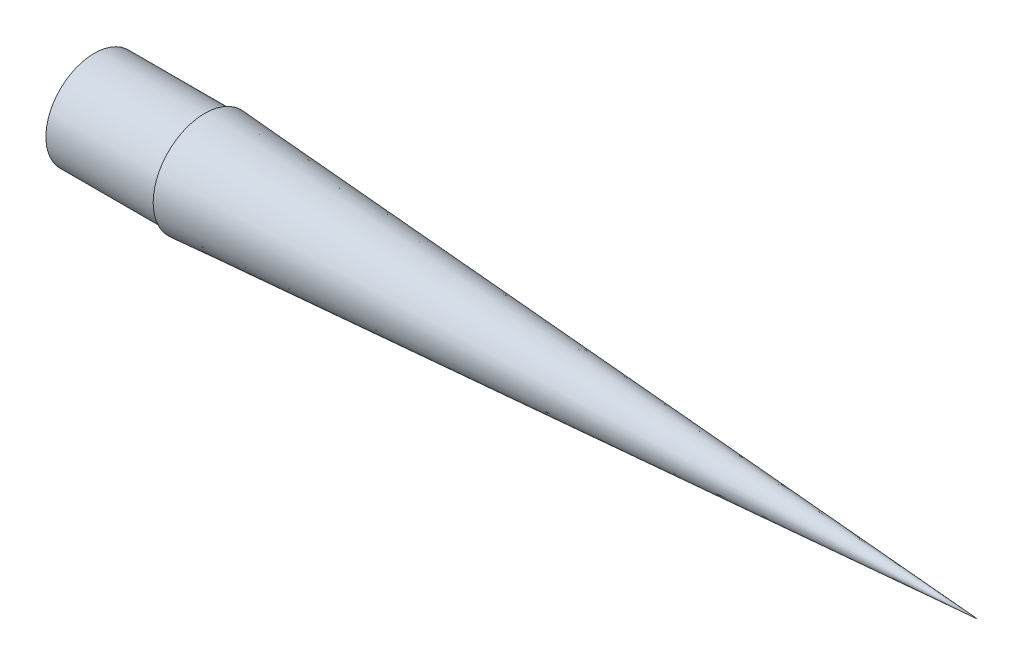
ISO-10303-21;
HEADER;
FILE_DESCRIPTION(('STEP AP214'),'2;1');
FILE_NAME('part.step','',(''),(''),'','','');
FILE_SCHEMA(('AUTOMOTIVE_DESIGN { 1 0 10303 214 1 1 1 1 }'));
ENDSEC;
DATA;
#1=APPLICATION_CONTEXT('core data for automotive mechanical design processes');
#2=APPLICATION_PROTOCOL_DEFINITION('international standard','automotive_design',2000,#1);
#3=PRODUCT_CONTEXT('',#1,'mechanical');
#4=PRODUCT('Part','Part','',(#3));
#5=PRODUCT_RELATED_PRODUCT_CATEGORY('part','',(#4));
#6=PRODUCT_DEFINITION_FORMATION('','',#4);
#7=PRODUCT_DEFINITION_CONTEXT('part definition',#1,'design');
#8=PRODUCT_DEFINITION('design','',#6,#7);
#9=PRODUCT_DEFINITION_SHAPE('','',#8);
#10=(LENGTH_UNIT() NAMED_UNIT(*) SI_UNIT(.MILLI.,.METRE.));
#11=(NAMED_UNIT(*) PLANE_ANGLE_UNIT() SI_UNIT($,.RADIAN.));
#12=(NAMED_UNIT(*) SI_UNIT($,.STERADIAN.) SOLID_ANGLE_UNIT());
#13=UNCERTAINTY_MEASURE_WITH_UNIT(LENGTH_MEASURE(1.E-05),#10,'distance_accuracy_value','');
#14=(GEOMETRIC_REPRESENTATION_CONTEXT(3) GLOBAL_UNCERTAINTY_ASSIGNED_CONTEXT((#13)) GLOBAL_UNIT_ASSIGNED_CONTEXT((#10,
#11,#12)) REPRESENTATION_CONTEXT('',''));
#15=CARTESIAN_POINT('',(0.,0.,0.));
#16=DIRECTION('',(0.,0.,1.));
#17=DIRECTION('',(1.,0.,0.));
#18=AXIS2_PLACEMENT_3D('',#15,#16,#17);
#19=CARTESIAN_POINT('',(0.,0.,-20.955));
#20=DIRECTION('',(-1.,0.,0.));
#21=DIRECTION('',(0.,0.,1.));
#22=AXIS2_PLACEMENT_3D('',#19,#20,#21);
#23=PLANE('',#22);
#24=CARTESIAN_POINT('',(0.,0.,1.44302991607847E-13));
#25=DIRECTION('',(1.,0.,0.));
#26=DIRECTION('',(0.,0.,-1.));
#27=AXIS2_PLACEMENT_3D('',#24,#25,#26);
#28=CIRCLE('',#27,20.9550000000001);
#29=CARTESIAN_POINT('',(0.,0.,-20.955));
#30=VERTEX_POINT('',#29);
#31=EDGE_CURVE('E62',#30,#30,#28,.T.);
#32=ORIENTED_EDGE('',*,*,#31,.T.);
#33=EDGE_LOOP('',(#32));
#34=FACE_BOUND('',#33,.T.);
#35=CARTESIAN_POINT('',(0.,0.,1.44302991607847E-13));
#36=DIRECTION('',(1.,0.,0.));
#37=DIRECTION('',(0.,0.,-1.));
#38=AXIS2_PLACEMENT_3D('',#35,#36,#37);
#39=CIRCLE('',#38,22.2250000000001);
#40=CARTESIAN_POINT('',(0.,0.,-22.225));
#41=VERTEX_POINT('',#40);
#42=EDGE_CURVE('E11',#41,#41,#39,.T.);
#43=ORIENTED_EDGE('',*,*,#42,.F.);
#44=EDGE_LOOP('',(#43));
#45=FACE_BOUND('',#44,.T.);
#46=ADVANCED_FACE('F33',(#34,#45),#23,.T.);
#47=CARTESIAN_POINT('',(406.4,0.,0.));
#48=DIRECTION('',(1.,0.,0.));
#49=DIRECTION('',(0.,0.,-1.));
#50=AXIS2_PLACEMENT_3D('',#47,#48,#49);
#51=CYLINDRICAL_SURFACE('',#50,22.2250000000001);
#52=ORIENTED_EDGE('',*,*,#42,.T.);
#53=EDGE_LOOP('',(#52));
#54=FACE_BOUND('',#53,.T.);
#55=CARTESIAN_POINT('',(50.8,0.,1.23338437573625E-13));
#56=DIRECTION('',(1.,0.,0.));
#57=DIRECTION('',(0.,0.,-1.));
#58=AXIS2_PLACEMENT_3D('',#55,#56,#57);
#59=CIRCLE('',#58,22.2250000000001);
#60=CARTESIAN_POINT('',(50.8,0.,-22.225));
#61=VERTEX_POINT('',#60);
#62=EDGE_CURVE('E40',#61,#61,#59,.T.);
#63=ORIENTED_EDGE('',*,*,#62,.F.);
#64=EDGE_LOOP('',(#63));
#65=FACE_BOUND('',#64,.T.);
#66=ADVANCED_FACE('F71',(#54,#65),#51,.T.);
#67=CARTESIAN_POINT('',(50.8,0.,-22.225));
#68=DIRECTION('',(-1.,0.,0.));
#69=DIRECTION('',(0.,0.,1.));
#70=AXIS2_PLACEMENT_3D('',#67,#68,#69);
#71=PLANE('',#70);
#72=ORIENTED_EDGE('',*,*,#62,.T.);
#73=EDGE_LOOP('',(#72));
#74=FACE_BOUND('',#73,.T.);
#75=CARTESIAN_POINT('',(50.8,0.,1.23338437573625E-13));
#76=DIRECTION('',(1.,0.,0.));
#77=DIRECTION('',(0.,0.,-1.));
#78=AXIS2_PLACEMENT_3D('',#75,#76,#77);
#79=CIRCLE('',#78,23.6982000000001);
#80=CARTESIAN_POINT('',(50.8,0.,-23.6982));
#81=VERTEX_POINT('',#80);
#82=EDGE_CURVE('E56',#81,#81,#79,.T.);
#83=ORIENTED_EDGE('',*,*,#82,.F.);
#84=EDGE_LOOP('',(#83));
#85=FACE_BOUND('',#84,.T.);
#86=ADVANCED_FACE('F68',(#74,#85),#71,.T.);
#87=CARTESIAN_POINT('',(406.4,0.,0.));
#88=DIRECTION('',(-1.,0.,0.));
#89=DIRECTION('',(0.,0.,1.));
#90=AXIS2_PLACEMENT_3D('',#87,#88,#89);
#91=CONICAL_SURFACE('',#90,0.,0.066544459566435);
#92=ORIENTED_EDGE('',*,*,#82,.T.);
#93=EDGE_LOOP('',(#92));
#94=FACE_BOUND('',#93,.T.);
#95=CARTESIAN_POINT('',(406.4,0.,0.));
#96=VERTEX_POINT('',#95);
#97=VERTEX_LOOP('',#96);
#98=FACE_BOUND('',#97,.T.);
#99=ADVANCED_FACE('F50',(#94,#98),#91,.T.);
#100=CARTESIAN_POINT('',(52.07,0.,1.2281432372277E-13));
#101=DIRECTION('',(-1.,0.,0.));
#102=DIRECTION('',(0.,0.,1.));
#103=AXIS2_PLACEMENT_3D('',#100,#101,#102);
#104=CONICAL_SURFACE('',#103,22.3407464891103,0.0665444595664349);
#105=CARTESIAN_POINT('',(387.300922666178,0.,0.));
#106=VERTEX_POINT('',#105);
#107=VERTEX_LOOP('',#106);
#108=FACE_BOUND('',#107,.T.);
#109=CARTESIAN_POINT('',(52.07,0.,1.2281432372277E-13));
#110=DIRECTION('',(1.,0.,0.));
#111=DIRECTION('',(0.,0.,-1.));
#112=AXIS2_PLACEMENT_3D('',#109,#110,#111);
#113=CIRCLE('',#112,22.3407464891103);
#114=CARTESIAN_POINT('',(52.07,0.,-22.3407464891102));
#115=VERTEX_POINT('',#114);
#116=EDGE_CURVE('E54',#115,#115,#113,.T.);
#117=ORIENTED_EDGE('',*,*,#116,.F.);
#118=EDGE_LOOP('',(#117));
#119=FACE_BOUND('',#118,.T.);
#120=ADVANCED_FACE('F46',(#108,#119),#104,.F.);
#121=CARTESIAN_POINT('',(52.07,0.,-20.955));
#122=DIRECTION('',(1.,0.,0.));
#123=DIRECTION('',(0.,0.,-1.));
#124=AXIS2_PLACEMENT_3D('',#121,#122,#123);
#125=PLANE('',#124);
#126=ORIENTED_EDGE('',*,*,#116,.T.);
#127=EDGE_LOOP('',(#126));
#128=FACE_BOUND('',#127,.T.);
#129=CARTESIAN_POINT('',(52.07,0.,1.2281432372277E-13));
#130=DIRECTION('',(1.,0.,0.));
#131=DIRECTION('',(0.,0.,-1.));
#132=AXIS2_PLACEMENT_3D('',#129,#130,#131);
#133=CIRCLE('',#132,20.9550000000001);
#134=CARTESIAN_POINT('',(52.07,0.,-20.955));
#135=VERTEX_POINT('',#134);
#136=EDGE_CURVE('E57',#135,#135,#133,.T.);
#137=ORIENTED_EDGE('',*,*,#136,.F.);
#138=EDGE_LOOP('',(#137));
#139=FACE_BOUND('',#138,.T.);
#140=ADVANCED_FACE('F49',(#128,#139),#125,.T.);
#141=CARTESIAN_POINT('',(406.4,0.,0.));
#142=DIRECTION('',(1.,0.,0.));
#143=DIRECTION('',(0.,0.,-1.));
#144=AXIS2_PLACEMENT_3D('',#141,#142,#143);
#145=CYLINDRICAL_SURFACE('',#144,20.9550000000001);
#146=ORIENTED_EDGE('',*,*,#136,.T.);
#147=EDGE_LOOP('',(#146));
#148=FACE_BOUND('',#147,.T.);
#149=ORIENTED_EDGE('',*,*,#31,.F.);
#150=EDGE_LOOP('',(#149));
#151=FACE_BOUND('',#150,.T.);
#152=ADVANCED_FACE('F86',(#148,#151),#145,.F.);
#153=CLOSED_SHELL('',(#46,#66,#86,#99,#120,#140,#152));
#154=MANIFOLD_SOLID_BREP('B2',#153);
#155=ADVANCED_BREP_SHAPE_REPRESENTATION('',(#18,#154),#14);
#156=SHAPE_DEFINITION_REPRESENTATION(#9,#155);
ENDSEC;
END-ISO-10303-21;
